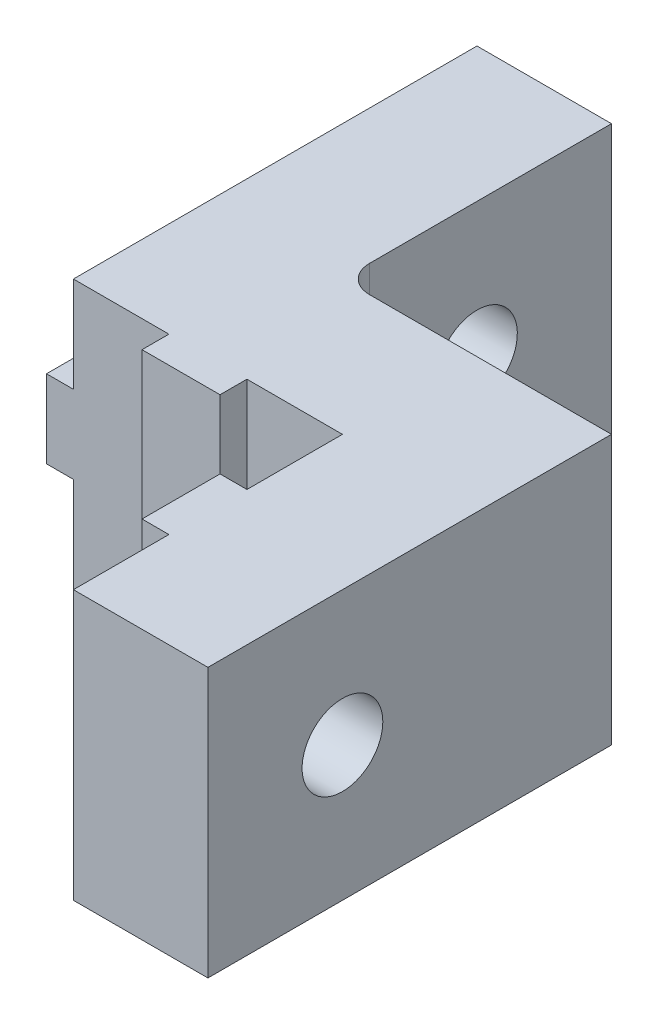
ISO-10303-21;
HEADER;
FILE_DESCRIPTION(('STEP AP214'),'2;1');
FILE_NAME('part.step','',(''),(''),'','','');
FILE_SCHEMA(('AUTOMOTIVE_DESIGN { 1 0 10303 214 1 1 1 1 }'));
ENDSEC;
DATA;
#1=APPLICATION_CONTEXT('core data for automotive mechanical design processes');
#2=APPLICATION_PROTOCOL_DEFINITION('international standard','automotive_design',2000,#1);
#3=PRODUCT_CONTEXT('',#1,'mechanical');
#4=PRODUCT('Part','Part','',(#3));
#5=PRODUCT_RELATED_PRODUCT_CATEGORY('part','',(#4));
#6=PRODUCT_DEFINITION_FORMATION('','',#4);
#7=PRODUCT_DEFINITION_CONTEXT('part definition',#1,'design');
#8=PRODUCT_DEFINITION('design','',#6,#7);
#9=PRODUCT_DEFINITION_SHAPE('','',#8);
#10=(LENGTH_UNIT() NAMED_UNIT(*) SI_UNIT(.MILLI.,.METRE.));
#11=(NAMED_UNIT(*) PLANE_ANGLE_UNIT() SI_UNIT($,.RADIAN.));
#12=(NAMED_UNIT(*) SI_UNIT($,.STERADIAN.) SOLID_ANGLE_UNIT());
#13=UNCERTAINTY_MEASURE_WITH_UNIT(LENGTH_MEASURE(1.E-05),#10,'distance_accuracy_value','');
#14=(GEOMETRIC_REPRESENTATION_CONTEXT(3) GLOBAL_UNCERTAINTY_ASSIGNED_CONTEXT((#13)) GLOBAL_UNIT_ASSIGNED_CONTEXT((#10,
#11,#12)) REPRESENTATION_CONTEXT('',''));
#15=CARTESIAN_POINT('',(0.,0.,0.));
#16=DIRECTION('',(0.,0.,1.));
#17=DIRECTION('',(1.,0.,0.));
#18=AXIS2_PLACEMENT_3D('',#15,#16,#17);
#19=CARTESIAN_POINT('',(10.,10.,21.45));
#20=DIRECTION('',(0.,0.,-1.));
#21=DIRECTION('',(-1.,0.,0.));
#22=AXIS2_PLACEMENT_3D('',#19,#20,#21);
#23=PLANE('',#22);
#24=DIRECTION('',(0.,-1.,0.));
#25=VECTOR('',#24,1.);
#26=CARTESIAN_POINT('',(9.,10.,21.45));
#27=LINE('',#26,#25);
#28=CARTESIAN_POINT('',(9.,10.,21.45));
#29=VERTEX_POINT('',#28);
#30=CARTESIAN_POINT('',(9.,5.38405728739343,21.45));
#31=VERTEX_POINT('',#30);
#32=EDGE_CURVE('E422',#29,#31,#27,.T.);
#33=ORIENTED_EDGE('',*,*,#32,.T.);
#34=DIRECTION('',(1.,0.,0.));
#35=VECTOR('',#34,1.);
#36=CARTESIAN_POINT('',(-1.,5.38405728739343,21.45));
#37=LINE('',#36,#35);
#38=CARTESIAN_POINT('',(10.,5.38405728739343,21.45));
#39=VERTEX_POINT('',#38);
#40=EDGE_CURVE('E499',#31,#39,#37,.T.);
#41=ORIENTED_EDGE('',*,*,#40,.T.);
#42=DIRECTION('',(0.,-1.,0.));
#43=VECTOR('',#42,1.);
#44=CARTESIAN_POINT('',(10.,10.,21.45));
#45=LINE('',#44,#43);
#46=CARTESIAN_POINT('',(10.,10.,21.45));
#47=VERTEX_POINT('',#46);
#48=EDGE_CURVE('E274',#47,#39,#45,.T.);
#49=ORIENTED_EDGE('',*,*,#48,.F.);
#50=DIRECTION('',(1.,0.,0.));
#51=VECTOR('',#50,1.);
#52=CARTESIAN_POINT('',(10.,10.,21.45));
#53=LINE('',#52,#51);
#54=EDGE_CURVE('E269',#29,#47,#53,.T.);
#55=ORIENTED_EDGE('',*,*,#54,.F.);
#56=EDGE_LOOP('',(#33,#41,#49,#55));
#57=FACE_BOUND('',#56,.T.);
#58=ADVANCED_FACE('F32',(#57),#23,.F.);
#59=CARTESIAN_POINT('',(9.,10.,21.45));
#60=DIRECTION('',(1.,0.,0.));
#61=DIRECTION('',(0.,0.,-1.));
#62=AXIS2_PLACEMENT_3D('',#59,#60,#61);
#63=PLANE('',#62);
#64=DIRECTION('',(0.,-1.,0.));
#65=VECTOR('',#64,1.);
#66=CARTESIAN_POINT('',(9.,10.,18.55));
#67=LINE('',#66,#65);
#68=CARTESIAN_POINT('',(9.,10.,18.55));
#69=VERTEX_POINT('',#68);
#70=CARTESIAN_POINT('',(9.,5.38405728739343,18.55));
#71=VERTEX_POINT('',#70);
#72=EDGE_CURVE('E253',#69,#71,#67,.T.);
#73=ORIENTED_EDGE('',*,*,#72,.T.);
#74=CARTESIAN_POINT('',(9.,5.,20.));
#75=DIRECTION('',(1.,0.,0.));
#76=DIRECTION('',(0.,0.,-1.));
#77=AXIS2_PLACEMENT_3D('',#74,#75,#76);
#78=CIRCLE('',#77,1.5);
#79=EDGE_CURVE('E503',#71,#31,#78,.T.);
#80=ORIENTED_EDGE('',*,*,#79,.T.);
#81=ORIENTED_EDGE('',*,*,#32,.F.);
#82=DIRECTION('',(0.,0.,1.));
#83=VECTOR('',#82,1.);
#84=CARTESIAN_POINT('',(9.,10.,21.45));
#85=LINE('',#84,#83);
#86=EDGE_CURVE('E453',#69,#29,#85,.T.);
#87=ORIENTED_EDGE('',*,*,#86,.F.);
#88=EDGE_LOOP('',(#73,#80,#81,#87));
#89=FACE_BOUND('',#88,.T.);
#90=ADVANCED_FACE('F388',(#89),#63,.F.);
#91=CARTESIAN_POINT('',(9.,10.,18.55));
#92=DIRECTION('',(0.,0.,1.));
#93=DIRECTION('',(1.,0.,0.));
#94=AXIS2_PLACEMENT_3D('',#91,#92,#93);
#95=PLANE('',#94);
#96=CARTESIAN_POINT('',(9.,4.61594271260657,18.55));
#97=VERTEX_POINT('',#96);
#98=CARTESIAN_POINT('',(9.,0.,18.55));
#99=VERTEX_POINT('',#98);
#100=EDGE_CURVE('E240',#97,#99,#67,.T.);
#101=ORIENTED_EDGE('',*,*,#100,.F.);
#102=DIRECTION('',(1.,0.,0.));
#103=VECTOR('',#102,1.);
#104=CARTESIAN_POINT('',(-1.,4.61594271260657,18.55));
#105=LINE('',#104,#103);
#106=CARTESIAN_POINT('',(10.,4.61594271260657,18.55));
#107=VERTEX_POINT('',#106);
#108=EDGE_CURVE('E224',#97,#107,#105,.T.);
#109=ORIENTED_EDGE('',*,*,#108,.T.);
#110=DIRECTION('',(0.,-1.,0.));
#111=VECTOR('',#110,1.);
#112=CARTESIAN_POINT('',(10.,10.,18.55));
#113=LINE('',#112,#111);
#114=CARTESIAN_POINT('',(10.,0.,18.55));
#115=VERTEX_POINT('',#114);
#116=EDGE_CURVE('E238',#107,#115,#113,.T.);
#117=ORIENTED_EDGE('',*,*,#116,.T.);
#118=DIRECTION('',(-1.,0.,0.));
#119=VECTOR('',#118,1.);
#120=CARTESIAN_POINT('',(9.,0.,18.55));
#121=LINE('',#120,#119);
#122=EDGE_CURVE('E432',#115,#99,#121,.T.);
#123=ORIENTED_EDGE('',*,*,#122,.T.);
#124=EDGE_LOOP('',(#101,#109,#117,#123));
#125=FACE_BOUND('',#124,.T.);
#126=ADVANCED_FACE('F236',(#125),#95,.F.);
#127=CARTESIAN_POINT('',(0.,6.45,25.));
#128=DIRECTION('',(0.,-1.,0.));
#129=DIRECTION('',(1.,0.,0.));
#130=AXIS2_PLACEMENT_3D('',#127,#128,#129);
#131=PLANE('',#130);
#132=DIRECTION('',(0.,0.,-1.));
#133=VECTOR('',#132,1.);
#134=CARTESIAN_POINT('',(-1.,6.45,25.));
#135=LINE('',#134,#133);
#136=CARTESIAN_POINT('',(-1.,6.45,4.61594271260657));
#137=VERTEX_POINT('',#136);
#138=CARTESIAN_POINT('',(-1.,6.45,0.));
#139=VERTEX_POINT('',#138);
#140=EDGE_CURVE('E340',#137,#139,#135,.T.);
#141=ORIENTED_EDGE('',*,*,#140,.F.);
#142=DIRECTION('',(1.,0.,0.));
#143=VECTOR('',#142,1.);
#144=CARTESIAN_POINT('',(-0.999999999999998,6.45,4.61594271260657));
#145=LINE('',#144,#143);
#146=CARTESIAN_POINT('',(0.,6.45,4.61594271260656));
#147=VERTEX_POINT('',#146);
#148=EDGE_CURVE('E451',#137,#147,#145,.T.);
#149=ORIENTED_EDGE('',*,*,#148,.T.);
#150=DIRECTION('',(0.,0.,-1.));
#151=VECTOR('',#150,1.);
#152=CARTESIAN_POINT('',(0.,6.45,25.));
#153=LINE('',#152,#151);
#154=CARTESIAN_POINT('',(0.,6.45,0.));
#155=VERTEX_POINT('',#154);
#156=EDGE_CURVE('E344',#147,#155,#153,.T.);
#157=ORIENTED_EDGE('',*,*,#156,.T.);
#158=DIRECTION('',(-1.,0.,0.));
#159=VECTOR('',#158,1.);
#160=CARTESIAN_POINT('',(0.,6.45,0.));
#161=LINE('',#160,#159);
#162=EDGE_CURVE('E311',#155,#139,#161,.T.);
#163=ORIENTED_EDGE('',*,*,#162,.T.);
#164=EDGE_LOOP('',(#141,#149,#157,#163));
#165=FACE_BOUND('',#164,.T.);
#166=ADVANCED_FACE('F557',(#165),#131,.F.);
#167=CARTESIAN_POINT('',(-1.,6.45,25.));
#168=DIRECTION('',(1.,0.,0.));
#169=DIRECTION('',(0.,0.,-1.));
#170=AXIS2_PLACEMENT_3D('',#167,#168,#169);
#171=PLANE('',#170);
#172=CARTESIAN_POINT('',(-1.,6.45,15.));
#173=VERTEX_POINT('',#172);
#174=CARTESIAN_POINT('',(-1.,6.45,5.38405728739343));
#175=VERTEX_POINT('',#174);
#176=EDGE_CURVE('E341',#173,#175,#135,.T.);
#177=ORIENTED_EDGE('',*,*,#176,.T.);
#178=CARTESIAN_POINT('',(-1.,5.,5.));
#179=DIRECTION('',(1.,0.,0.));
#180=DIRECTION('',(0.,0.,-1.));
#181=AXIS2_PLACEMENT_3D('',#178,#179,#180);
#182=CIRCLE('',#181,1.5);
#183=CARTESIAN_POINT('',(-1.,3.55,5.38405728739344));
#184=VERTEX_POINT('',#183);
#185=EDGE_CURVE('E352',#175,#184,#182,.T.);
#186=ORIENTED_EDGE('',*,*,#185,.T.);
#187=DIRECTION('',(0.,0.,-1.));
#188=VECTOR('',#187,1.);
#189=CARTESIAN_POINT('',(-1.,3.55,25.));
#190=LINE('',#189,#188);
#191=CARTESIAN_POINT('',(-1.,3.55,15.));
#192=VERTEX_POINT('',#191);
#193=EDGE_CURVE('E337',#192,#184,#190,.T.);
#194=ORIENTED_EDGE('',*,*,#193,.F.);
#195=DIRECTION('',(0.,-1.,0.));
#196=VECTOR('',#195,1.);
#197=CARTESIAN_POINT('',(-1.,10.,15.));
#198=LINE('',#197,#196);
#199=EDGE_CURVE('E264',#173,#192,#198,.T.);
#200=ORIENTED_EDGE('',*,*,#199,.F.);
#201=EDGE_LOOP('',(#177,#186,#194,#200));
#202=FACE_BOUND('',#201,.T.);
#203=ADVANCED_FACE('F552',(#202),#171,.F.);
#204=CARTESIAN_POINT('',(-1.,3.55,25.));
#205=DIRECTION('',(0.,1.,0.));
#206=DIRECTION('',(-1.,0.,0.));
#207=AXIS2_PLACEMENT_3D('',#204,#205,#206);
#208=PLANE('',#207);
#209=ORIENTED_EDGE('',*,*,#193,.T.);
#210=DIRECTION('',(1.,0.,0.));
#211=VECTOR('',#210,1.);
#212=CARTESIAN_POINT('',(-1.,3.55,5.38405728739344));
#213=LINE('',#212,#211);
#214=CARTESIAN_POINT('',(0.,3.55,5.38405728739344));
#215=VERTEX_POINT('',#214);
#216=EDGE_CURVE('E486',#184,#215,#213,.T.);
#217=ORIENTED_EDGE('',*,*,#216,.T.);
#218=DIRECTION('',(0.,0.,-1.));
#219=VECTOR('',#218,1.);
#220=CARTESIAN_POINT('',(0.,3.55,25.));
#221=LINE('',#220,#219);
#222=CARTESIAN_POINT('',(0.,3.55,15.));
#223=VERTEX_POINT('',#222);
#224=EDGE_CURVE('E333',#223,#215,#221,.T.);
#225=ORIENTED_EDGE('',*,*,#224,.F.);
#226=DIRECTION('',(-1.,0.,0.));
#227=VECTOR('',#226,1.);
#228=CARTESIAN_POINT('',(-1.,3.55,15.));
#229=LINE('',#228,#227);
#230=EDGE_CURVE('E273',#223,#192,#229,.T.);
#231=ORIENTED_EDGE('',*,*,#230,.T.);
#232=EDGE_LOOP('',(#209,#217,#225,#231));
#233=FACE_BOUND('',#232,.T.);
#234=ADVANCED_FACE('F547',(#233),#208,.F.);
#235=CARTESIAN_POINT('',(15.,10.,25.));
#236=DIRECTION('',(0.,-1.,0.));
#237=DIRECTION('',(0.,0.,-1.));
#238=AXIS2_PLACEMENT_3D('',#235,#236,#237);
#239=PLANE('',#238);
#240=ORIENTED_EDGE('',*,*,#54,.T.);
#241=DIRECTION('',(0.,0.,1.));
#242=VECTOR('',#241,1.);
#243=CARTESIAN_POINT('',(10.,10.,25.));
#244=LINE('',#243,#242);
#245=CARTESIAN_POINT('',(10.,10.,25.));
#246=VERTEX_POINT('',#245);
#247=EDGE_CURVE('E428',#47,#246,#244,.T.);
#248=ORIENTED_EDGE('',*,*,#247,.T.);
#249=DIRECTION('',(-1.,0.,0.));
#250=VECTOR('',#249,1.);
#251=CARTESIAN_POINT('',(15.,10.,25.));
#252=LINE('',#251,#250);
#253=CARTESIAN_POINT('',(15.,10.,25.));
#254=VERTEX_POINT('',#253);
#255=EDGE_CURVE('E297',#254,#246,#252,.T.);
#256=ORIENTED_EDGE('',*,*,#255,.F.);
#257=DIRECTION('',(0.,0.,-1.));
#258=VECTOR('',#257,1.);
#259=CARTESIAN_POINT('',(15.,10.,25.));
#260=LINE('',#259,#258);
#261=CARTESIAN_POINT('',(15.,10.,10.));
#262=VERTEX_POINT('',#261);
#263=EDGE_CURVE('E305',#254,#262,#260,.T.);
#264=ORIENTED_EDGE('',*,*,#263,.T.);
#265=DIRECTION('',(-1.,0.,0.));
#266=VECTOR('',#265,1.);
#267=CARTESIAN_POINT('',(15.,10.,10.));
#268=LINE('',#267,#266);
#269=CARTESIAN_POINT('',(6.,10.,10.));
#270=VERTEX_POINT('',#269);
#271=EDGE_CURVE('E284',#262,#270,#268,.T.);
#272=ORIENTED_EDGE('',*,*,#271,.T.);
#273=CARTESIAN_POINT('',(6.,10.,9.));
#274=DIRECTION('',(0.,-1.,0.));
#275=DIRECTION('',(0.,0.,-1.));
#276=AXIS2_PLACEMENT_3D('',#273,#274,#275);
#277=CIRCLE('',#276,1.);
#278=CARTESIAN_POINT('',(5.,10.,9.));
#279=VERTEX_POINT('',#278);
#280=EDGE_CURVE('E11',#270,#279,#277,.T.);
#281=ORIENTED_EDGE('',*,*,#280,.T.);
#282=DIRECTION('',(0.,0.,-1.));
#283=VECTOR('',#282,1.);
#284=CARTESIAN_POINT('',(5.,10.,0.));
#285=LINE('',#284,#283);
#286=CARTESIAN_POINT('',(5.,10.,0.));
#287=VERTEX_POINT('',#286);
#288=EDGE_CURVE('E286',#279,#287,#285,.T.);
#289=ORIENTED_EDGE('',*,*,#288,.T.);
#290=DIRECTION('',(-1.,0.,0.));
#291=VECTOR('',#290,1.);
#292=CARTESIAN_POINT('',(15.,10.,0.));
#293=LINE('',#292,#291);
#294=CARTESIAN_POINT('',(0.,10.,0.));
#295=VERTEX_POINT('',#294);
#296=EDGE_CURVE('E295',#287,#295,#293,.T.);
#297=ORIENTED_EDGE('',*,*,#296,.T.);
#298=DIRECTION('',(0.,0.,-1.));
#299=VECTOR('',#298,1.);
#300=CARTESIAN_POINT('',(0.,10.,25.));
#301=LINE('',#300,#299);
#302=CARTESIAN_POINT('',(0.,10.,15.));
#303=VERTEX_POINT('',#302);
#304=EDGE_CURVE('E232',#303,#295,#301,.T.);
#305=ORIENTED_EDGE('',*,*,#304,.F.);
#306=DIRECTION('',(1.,0.,0.));
#307=VECTOR('',#306,1.);
#308=CARTESIAN_POINT('',(3.55,10.,15.));
#309=LINE('',#308,#307);
#310=CARTESIAN_POINT('',(3.55,10.,15.));
#311=VERTEX_POINT('',#310);
#312=EDGE_CURVE('E474',#303,#311,#309,.T.);
#313=ORIENTED_EDGE('',*,*,#312,.T.);
#314=DIRECTION('',(0.,0.,1.));
#315=VECTOR('',#314,1.);
#316=CARTESIAN_POINT('',(3.55,10.,16.));
#317=LINE('',#316,#315);
#318=CARTESIAN_POINT('',(3.55,10.,16.));
#319=VERTEX_POINT('',#318);
#320=EDGE_CURVE('E471',#311,#319,#317,.T.);
#321=ORIENTED_EDGE('',*,*,#320,.T.);
#322=DIRECTION('',(1.,0.,0.));
#323=VECTOR('',#322,1.);
#324=CARTESIAN_POINT('',(6.45,10.,16.));
#325=LINE('',#324,#323);
#326=CARTESIAN_POINT('',(6.45,10.,16.));
#327=VERTEX_POINT('',#326);
#328=EDGE_CURVE('E468',#319,#327,#325,.T.);
#329=ORIENTED_EDGE('',*,*,#328,.T.);
#330=DIRECTION('',(0.,0.,-1.));
#331=VECTOR('',#330,1.);
#332=CARTESIAN_POINT('',(6.45,10.,15.));
#333=LINE('',#332,#331);
#334=CARTESIAN_POINT('',(6.45,10.,15.));
#335=VERTEX_POINT('',#334);
#336=EDGE_CURVE('E465',#327,#335,#333,.T.);
#337=ORIENTED_EDGE('',*,*,#336,.T.);
#338=DIRECTION('',(1.,0.,0.));
#339=VECTOR('',#338,1.);
#340=CARTESIAN_POINT('',(10.,10.,15.));
#341=LINE('',#340,#339);
#342=CARTESIAN_POINT('',(10.,10.,15.));
#343=VERTEX_POINT('',#342);
#344=EDGE_CURVE('E462',#335,#343,#341,.T.);
#345=ORIENTED_EDGE('',*,*,#344,.T.);
#346=DIRECTION('',(0.,0.,1.));
#347=VECTOR('',#346,1.);
#348=CARTESIAN_POINT('',(10.,10.,18.55));
#349=LINE('',#348,#347);
#350=CARTESIAN_POINT('',(10.,10.,18.55));
#351=VERTEX_POINT('',#350);
#352=EDGE_CURVE('E459',#343,#351,#349,.T.);
#353=ORIENTED_EDGE('',*,*,#352,.T.);
#354=DIRECTION('',(-1.,0.,0.));
#355=VECTOR('',#354,1.);
#356=CARTESIAN_POINT('',(9.,10.,18.55));
#357=LINE('',#356,#355);
#358=EDGE_CURVE('E456',#351,#69,#357,.T.);
#359=ORIENTED_EDGE('',*,*,#358,.T.);
#360=ORIENTED_EDGE('',*,*,#86,.T.);
#361=EDGE_LOOP('',(#240,#248,#256,#264,#272,#281,#289,#297,#305,#313,#321,#329,#337,#345,#353,
#359,#360));
#362=FACE_BOUND('',#361,.T.);
#363=ADVANCED_FACE('F378',(#362),#239,.F.);
#364=CARTESIAN_POINT('',(0.,10.,25.));
#365=DIRECTION('',(1.,0.,0.));
#366=DIRECTION('',(0.,1.,0.));
#367=AXIS2_PLACEMENT_3D('',#364,#365,#366);
#368=PLANE('',#367);
#369=ORIENTED_EDGE('',*,*,#156,.F.);
#370=CARTESIAN_POINT('',(0.,5.,5.));
#371=DIRECTION('',(1.,0.,0.));
#372=DIRECTION('',(0.,1.,0.));
#373=AXIS2_PLACEMENT_3D('',#370,#371,#372);
#374=CIRCLE('',#373,1.5);
#375=CARTESIAN_POINT('',(0.,6.45,5.38405728739343));
#376=VERTEX_POINT('',#375);
#377=EDGE_CURVE('E480',#147,#376,#374,.T.);
#378=ORIENTED_EDGE('',*,*,#377,.T.);
#379=CARTESIAN_POINT('',(0.,6.45,15.));
#380=VERTEX_POINT('',#379);
#381=EDGE_CURVE('E345',#380,#376,#153,.T.);
#382=ORIENTED_EDGE('',*,*,#381,.F.);
#383=DIRECTION('',(0.,1.,0.));
#384=VECTOR('',#383,1.);
#385=CARTESIAN_POINT('',(0.,10.,15.));
#386=LINE('',#385,#384);
#387=EDGE_CURVE('E280',#380,#303,#386,.T.);
#388=ORIENTED_EDGE('',*,*,#387,.T.);
#389=ORIENTED_EDGE('',*,*,#304,.T.);
#390=DIRECTION('',(0.,-1.,0.));
#391=VECTOR('',#390,1.);
#392=CARTESIAN_POINT('',(0.,10.,0.));
#393=LINE('',#392,#391);
#394=EDGE_CURVE('E308',#295,#155,#393,.T.);
#395=ORIENTED_EDGE('',*,*,#394,.T.);
#396=EDGE_LOOP('',(#369,#378,#382,#388,#389,#395));
#397=FACE_BOUND('',#396,.T.);
#398=ADVANCED_FACE('F555',(#397),#368,.F.);
#399=ORIENTED_EDGE('',*,*,#381,.T.);
#400=DIRECTION('',(1.,0.,0.));
#401=VECTOR('',#400,1.);
#402=CARTESIAN_POINT('',(-0.999999999999998,6.45,5.38405728739343));
#403=LINE('',#402,#401);
#404=EDGE_CURVE('E483',#376,#175,#403,.F.);
#405=ORIENTED_EDGE('',*,*,#404,.T.);
#406=ORIENTED_EDGE('',*,*,#176,.F.);
#407=DIRECTION('',(1.,0.,0.));
#408=VECTOR('',#407,1.);
#409=CARTESIAN_POINT('',(0.,6.45,15.));
#410=LINE('',#409,#408);
#411=EDGE_CURVE('E277',#173,#380,#410,.T.);
#412=ORIENTED_EDGE('',*,*,#411,.T.);
#413=EDGE_LOOP('',(#399,#405,#406,#412));
#414=FACE_BOUND('',#413,.T.);
#415=ADVANCED_FACE('F550',(#414),#131,.F.);
#416=CARTESIAN_POINT('',(-1.,3.55,4.61594271260656));
#417=VERTEX_POINT('',#416);
#418=CARTESIAN_POINT('',(-1.,3.55,0.));
#419=VERTEX_POINT('',#418);
#420=EDGE_CURVE('E336',#417,#419,#190,.T.);
#421=ORIENTED_EDGE('',*,*,#420,.F.);
#422=EDGE_CURVE('E494',#417,#137,#182,.T.);
#423=ORIENTED_EDGE('',*,*,#422,.T.);
#424=ORIENTED_EDGE('',*,*,#140,.T.);
#425=DIRECTION('',(0.,-1.,0.));
#426=VECTOR('',#425,1.);
#427=CARTESIAN_POINT('',(-1.,6.45,0.));
#428=LINE('',#427,#426);
#429=EDGE_CURVE('E314',#139,#419,#428,.T.);
#430=ORIENTED_EDGE('',*,*,#429,.T.);
#431=EDGE_LOOP('',(#421,#423,#424,#430));
#432=FACE_BOUND('',#431,.T.);
#433=ADVANCED_FACE('F545',(#432),#171,.F.);
#434=CARTESIAN_POINT('',(0.,3.55,4.61594271260656));
#435=VERTEX_POINT('',#434);
#436=CARTESIAN_POINT('',(0.,3.55,0.));
#437=VERTEX_POINT('',#436);
#438=EDGE_CURVE('E332',#435,#437,#221,.T.);
#439=ORIENTED_EDGE('',*,*,#438,.F.);
#440=DIRECTION('',(1.,0.,0.));
#441=VECTOR('',#440,1.);
#442=CARTESIAN_POINT('',(-1.,3.55,4.61594271260656));
#443=LINE('',#442,#441);
#444=EDGE_CURVE('E489',#435,#417,#443,.F.);
#445=ORIENTED_EDGE('',*,*,#444,.T.);
#446=ORIENTED_EDGE('',*,*,#420,.T.);
#447=DIRECTION('',(1.,0.,0.));
#448=VECTOR('',#447,1.);
#449=CARTESIAN_POINT('',(-1.,3.55,0.));
#450=LINE('',#449,#448);
#451=EDGE_CURVE('E317',#419,#437,#450,.T.);
#452=ORIENTED_EDGE('',*,*,#451,.T.);
#453=EDGE_LOOP('',(#439,#445,#446,#452));
#454=FACE_BOUND('',#453,.T.);
#455=ADVANCED_FACE('F541',(#454),#208,.F.);
#456=CARTESIAN_POINT('',(0.,3.55,25.));
#457=DIRECTION('',(1.,0.,0.));
#458=DIRECTION('',(0.,0.,-1.));
#459=AXIS2_PLACEMENT_3D('',#456,#457,#458);
#460=PLANE('',#459);
#461=ORIENTED_EDGE('',*,*,#224,.T.);
#462=CARTESIAN_POINT('',(0.,5.,5.));
#463=DIRECTION('',(1.,0.,0.));
#464=DIRECTION('',(0.,0.,-1.));
#465=AXIS2_PLACEMENT_3D('',#462,#463,#464);
#466=CIRCLE('',#465,1.5);
#467=EDGE_CURVE('E351',#215,#435,#466,.T.);
#468=ORIENTED_EDGE('',*,*,#467,.T.);
#469=ORIENTED_EDGE('',*,*,#438,.T.);
#470=DIRECTION('',(0.,-1.,0.));
#471=VECTOR('',#470,1.);
#472=CARTESIAN_POINT('',(0.,3.55,0.));
#473=LINE('',#472,#471);
#474=CARTESIAN_POINT('',(0.,0.,0.));
#475=VERTEX_POINT('',#474);
#476=EDGE_CURVE('E320',#437,#475,#473,.T.);
#477=ORIENTED_EDGE('',*,*,#476,.T.);
#478=DIRECTION('',(0.,0.,-1.));
#479=VECTOR('',#478,1.);
#480=CARTESIAN_POINT('',(0.,0.,25.));
#481=LINE('',#480,#479);
#482=CARTESIAN_POINT('',(0.,0.,15.));
#483=VERTEX_POINT('',#482);
#484=EDGE_CURVE('E330',#483,#475,#481,.T.);
#485=ORIENTED_EDGE('',*,*,#484,.F.);
#486=DIRECTION('',(0.,1.,0.));
#487=VECTOR('',#486,1.);
#488=CARTESIAN_POINT('',(0.,3.55,15.));
#489=LINE('',#488,#487);
#490=EDGE_CURVE('E270',#483,#223,#489,.T.);
#491=ORIENTED_EDGE('',*,*,#490,.T.);
#492=EDGE_LOOP('',(#461,#468,#469,#477,#485,#491));
#493=FACE_BOUND('',#492,.T.);
#494=ADVANCED_FACE('F538',(#493),#460,.F.);
#495=CARTESIAN_POINT('',(0.,0.,25.));
#496=DIRECTION('',(0.,1.,0.));
#497=DIRECTION('',(0.,0.,1.));
#498=AXIS2_PLACEMENT_3D('',#495,#496,#497);
#499=PLANE('',#498);
#500=DIRECTION('',(1.,0.,0.));
#501=VECTOR('',#500,1.);
#502=CARTESIAN_POINT('',(0.,0.,25.));
#503=LINE('',#502,#501);
#504=CARTESIAN_POINT('',(10.,0.,25.));
#505=VERTEX_POINT('',#504);
#506=CARTESIAN_POINT('',(15.,0.,25.));
#507=VERTEX_POINT('',#506);
#508=EDGE_CURVE('E300',#505,#507,#503,.T.);
#509=ORIENTED_EDGE('',*,*,#508,.F.);
#510=DIRECTION('',(0.,0.,1.));
#511=VECTOR('',#510,1.);
#512=CARTESIAN_POINT('',(10.,0.,25.));
#513=LINE('',#512,#511);
#514=CARTESIAN_POINT('',(10.,0.,21.45));
#515=VERTEX_POINT('',#514);
#516=EDGE_CURVE('E449',#515,#505,#513,.T.);
#517=ORIENTED_EDGE('',*,*,#516,.F.);
#518=DIRECTION('',(1.,0.,0.));
#519=VECTOR('',#518,1.);
#520=CARTESIAN_POINT('',(10.,0.,21.45));
#521=LINE('',#520,#519);
#522=CARTESIAN_POINT('',(9.,0.,21.45));
#523=VERTEX_POINT('',#522);
#524=EDGE_CURVE('E419',#523,#515,#521,.T.);
#525=ORIENTED_EDGE('',*,*,#524,.F.);
#526=DIRECTION('',(0.,0.,1.));
#527=VECTOR('',#526,1.);
#528=CARTESIAN_POINT('',(9.,0.,21.45));
#529=LINE('',#528,#527);
#530=EDGE_CURVE('E429',#99,#523,#529,.T.);
#531=ORIENTED_EDGE('',*,*,#530,.F.);
#532=ORIENTED_EDGE('',*,*,#122,.F.);
#533=DIRECTION('',(0.,0.,1.));
#534=VECTOR('',#533,1.);
#535=CARTESIAN_POINT('',(10.,0.,18.55));
#536=LINE('',#535,#534);
#537=CARTESIAN_POINT('',(10.,0.,15.));
#538=VERTEX_POINT('',#537);
#539=EDGE_CURVE('E245',#538,#115,#536,.T.);
#540=ORIENTED_EDGE('',*,*,#539,.F.);
#541=DIRECTION('',(1.,0.,0.));
#542=VECTOR('',#541,1.);
#543=CARTESIAN_POINT('',(10.,0.,15.));
#544=LINE('',#543,#542);
#545=CARTESIAN_POINT('',(6.45,0.,15.));
#546=VERTEX_POINT('',#545);
#547=EDGE_CURVE('E435',#546,#538,#544,.T.);
#548=ORIENTED_EDGE('',*,*,#547,.F.);
#549=DIRECTION('',(0.,0.,-1.));
#550=VECTOR('',#549,1.);
#551=CARTESIAN_POINT('',(6.45,0.,15.));
#552=LINE('',#551,#550);
#553=CARTESIAN_POINT('',(6.45,0.,16.));
#554=VERTEX_POINT('',#553);
#555=EDGE_CURVE('E438',#554,#546,#552,.T.);
#556=ORIENTED_EDGE('',*,*,#555,.F.);
#557=DIRECTION('',(1.,0.,0.));
#558=VECTOR('',#557,1.);
#559=CARTESIAN_POINT('',(6.45,0.,16.));
#560=LINE('',#559,#558);
#561=CARTESIAN_POINT('',(3.55,0.,16.));
#562=VERTEX_POINT('',#561);
#563=EDGE_CURVE('E441',#562,#554,#560,.T.);
#564=ORIENTED_EDGE('',*,*,#563,.F.);
#565=DIRECTION('',(0.,0.,1.));
#566=VECTOR('',#565,1.);
#567=CARTESIAN_POINT('',(3.55,0.,16.));
#568=LINE('',#567,#566);
#569=CARTESIAN_POINT('',(3.55,0.,15.));
#570=VERTEX_POINT('',#569);
#571=EDGE_CURVE('E444',#570,#562,#568,.T.);
#572=ORIENTED_EDGE('',*,*,#571,.F.);
#573=DIRECTION('',(1.,0.,0.));
#574=VECTOR('',#573,1.);
#575=CARTESIAN_POINT('',(3.55,0.,15.));
#576=LINE('',#575,#574);
#577=EDGE_CURVE('E447',#483,#570,#576,.T.);
#578=ORIENTED_EDGE('',*,*,#577,.F.);
#579=ORIENTED_EDGE('',*,*,#484,.T.);
#580=DIRECTION('',(1.,0.,0.));
#581=VECTOR('',#580,1.);
#582=CARTESIAN_POINT('',(0.,0.,0.));
#583=LINE('',#582,#581);
#584=CARTESIAN_POINT('',(5.,0.,0.));
#585=VERTEX_POINT('',#584);
#586=EDGE_CURVE('E301',#475,#585,#583,.T.);
#587=ORIENTED_EDGE('',*,*,#586,.T.);
#588=DIRECTION('',(0.,0.,-1.));
#589=VECTOR('',#588,1.);
#590=CARTESIAN_POINT('',(5.,0.,0.));
#591=LINE('',#590,#589);
#592=CARTESIAN_POINT('',(5.,0.,9.));
#593=VERTEX_POINT('',#592);
#594=EDGE_CURVE('E287',#593,#585,#591,.T.);
#595=ORIENTED_EDGE('',*,*,#594,.F.);
#596=CARTESIAN_POINT('',(6.,0.,9.));
#597=DIRECTION('',(0.,1.,0.));
#598=DIRECTION('',(0.,0.,1.));
#599=AXIS2_PLACEMENT_3D('',#596,#597,#598);
#600=CIRCLE('',#599,1.);
#601=CARTESIAN_POINT('',(6.,0.,10.));
#602=VERTEX_POINT('',#601);
#603=EDGE_CURVE('E40',#593,#602,#600,.T.);
#604=ORIENTED_EDGE('',*,*,#603,.T.);
#605=DIRECTION('',(-1.,0.,0.));
#606=VECTOR('',#605,1.);
#607=CARTESIAN_POINT('',(15.,0.,10.));
#608=LINE('',#607,#606);
#609=CARTESIAN_POINT('',(15.,0.,10.));
#610=VERTEX_POINT('',#609);
#611=EDGE_CURVE('E283',#610,#602,#608,.T.);
#612=ORIENTED_EDGE('',*,*,#611,.F.);
#613=DIRECTION('',(0.,0.,-1.));
#614=VECTOR('',#613,1.);
#615=CARTESIAN_POINT('',(15.,0.,25.));
#616=LINE('',#615,#614);
#617=EDGE_CURVE('E327',#507,#610,#616,.T.);
#618=ORIENTED_EDGE('',*,*,#617,.F.);
#619=EDGE_LOOP('',(#509,#517,#525,#531,#532,#540,#548,#556,#564,#572,#578,#579,#587,#595,#604,
#612,#618));
#620=FACE_BOUND('',#619,.T.);
#621=ADVANCED_FACE('F364',(#620),#499,.F.);
#622=CARTESIAN_POINT('',(15.,0.,25.));
#623=DIRECTION('',(-1.,0.,0.));
#624=DIRECTION('',(0.,0.,1.));
#625=AXIS2_PLACEMENT_3D('',#622,#623,#624);
#626=PLANE('',#625);
#627=CARTESIAN_POINT('',(15.,5.,20.));
#628=DIRECTION('',(1.,0.,0.));
#629=DIRECTION('',(0.,0.,-1.));
#630=AXIS2_PLACEMENT_3D('',#627,#628,#629);
#631=CIRCLE('',#630,1.5);
#632=CARTESIAN_POINT('',(15.,5.,18.5));
#633=VERTEX_POINT('',#632);
#634=EDGE_CURVE('E506',#633,#633,#631,.T.);
#635=ORIENTED_EDGE('',*,*,#634,.F.);
#636=EDGE_LOOP('',(#635));
#637=FACE_BOUND('',#636,.T.);
#638=ORIENTED_EDGE('',*,*,#617,.T.);
#639=DIRECTION('',(0.,-1.,0.));
#640=VECTOR('',#639,1.);
#641=CARTESIAN_POINT('',(15.,10.,10.));
#642=LINE('',#641,#640);
#643=EDGE_CURVE('E289',#262,#610,#642,.T.);
#644=ORIENTED_EDGE('',*,*,#643,.F.);
#645=ORIENTED_EDGE('',*,*,#263,.F.);
#646=DIRECTION('',(0.,1.,0.));
#647=VECTOR('',#646,1.);
#648=CARTESIAN_POINT('',(15.,0.,25.));
#649=LINE('',#648,#647);
#650=EDGE_CURVE('E303',#507,#254,#649,.T.);
#651=ORIENTED_EDGE('',*,*,#650,.F.);
#652=EDGE_LOOP('',(#638,#644,#645,#651));
#653=FACE_BOUND('',#652,.T.);
#654=ADVANCED_FACE('F510',(#637,#653),#626,.F.);
#655=CARTESIAN_POINT('',(0.,0.,25.));
#656=DIRECTION('',(0.,0.,1.));
#657=DIRECTION('',(1.,0.,0.));
#658=AXIS2_PLACEMENT_3D('',#655,#656,#657);
#659=PLANE('',#658);
#660=DIRECTION('',(0.,-1.,0.));
#661=VECTOR('',#660,1.);
#662=CARTESIAN_POINT('',(10.,10.,25.));
#663=LINE('',#662,#661);
#664=EDGE_CURVE('E266',#246,#505,#663,.T.);
#665=ORIENTED_EDGE('',*,*,#664,.T.);
#666=ORIENTED_EDGE('',*,*,#508,.T.);
#667=ORIENTED_EDGE('',*,*,#650,.T.);
#668=ORIENTED_EDGE('',*,*,#255,.T.);
#669=EDGE_LOOP('',(#665,#666,#667,#668));
#670=FACE_BOUND('',#669,.T.);
#671=ADVANCED_FACE('F513',(#670),#659,.T.);
#672=CARTESIAN_POINT('',(0.,0.,0.));
#673=DIRECTION('',(0.,0.,1.));
#674=DIRECTION('',(1.,0.,0.));
#675=AXIS2_PLACEMENT_3D('',#672,#673,#674);
#676=PLANE('',#675);
#677=ORIENTED_EDGE('',*,*,#296,.F.);
#678=DIRECTION('',(0.,-1.,0.));
#679=VECTOR('',#678,1.);
#680=CARTESIAN_POINT('',(5.,10.,0.));
#681=LINE('',#680,#679);
#682=EDGE_CURVE('E292',#287,#585,#681,.T.);
#683=ORIENTED_EDGE('',*,*,#682,.T.);
#684=ORIENTED_EDGE('',*,*,#586,.F.);
#685=ORIENTED_EDGE('',*,*,#476,.F.);
#686=ORIENTED_EDGE('',*,*,#451,.F.);
#687=ORIENTED_EDGE('',*,*,#429,.F.);
#688=ORIENTED_EDGE('',*,*,#162,.F.);
#689=ORIENTED_EDGE('',*,*,#394,.F.);
#690=EDGE_LOOP('',(#677,#683,#684,#685,#686,#687,#688,#689));
#691=FACE_BOUND('',#690,.T.);
#692=ADVANCED_FACE('F371',(#691),#676,.F.);
#693=CARTESIAN_POINT('',(5.,10.,0.));
#694=DIRECTION('',(-1.,0.,0.));
#695=DIRECTION('',(0.,0.,1.));
#696=AXIS2_PLACEMENT_3D('',#693,#694,#695);
#697=PLANE('',#696);
#698=CARTESIAN_POINT('',(5.,5.,5.));
#699=DIRECTION('',(-1.,0.,0.));
#700=DIRECTION('',(0.,0.,1.));
#701=AXIS2_PLACEMENT_3D('',#698,#699,#700);
#702=CIRCLE('',#701,1.5);
#703=CARTESIAN_POINT('',(5.,5.,6.5));
#704=VERTEX_POINT('',#703);
#705=EDGE_CURVE('E349',#704,#704,#702,.T.);
#706=ORIENTED_EDGE('',*,*,#705,.T.);
#707=EDGE_LOOP('',(#706));
#708=FACE_BOUND('',#707,.T.);
#709=ORIENTED_EDGE('',*,*,#288,.F.);
#710=DIRECTION('',(0.,-1.,0.));
#711=VECTOR('',#710,1.);
#712=CARTESIAN_POINT('',(5.,0.,9.));
#713=LINE('',#712,#711);
#714=EDGE_CURVE('E231',#279,#593,#713,.T.);
#715=ORIENTED_EDGE('',*,*,#714,.T.);
#716=ORIENTED_EDGE('',*,*,#594,.T.);
#717=ORIENTED_EDGE('',*,*,#682,.F.);
#718=EDGE_LOOP('',(#709,#715,#716,#717));
#719=FACE_BOUND('',#718,.T.);
#720=ADVANCED_FACE('F359',(#708,#719),#697,.F.);
#721=CARTESIAN_POINT('',(15.,10.,10.));
#722=DIRECTION('',(0.,0.,1.));
#723=DIRECTION('',(1.,0.,0.));
#724=AXIS2_PLACEMENT_3D('',#721,#722,#723);
#725=PLANE('',#724);
#726=ORIENTED_EDGE('',*,*,#611,.T.);
#727=DIRECTION('',(0.,-1.,0.));
#728=VECTOR('',#727,1.);
#729=CARTESIAN_POINT('',(6.,10.,10.));
#730=LINE('',#729,#728);
#731=EDGE_CURVE('E47',#602,#270,#730,.F.);
#732=ORIENTED_EDGE('',*,*,#731,.T.);
#733=ORIENTED_EDGE('',*,*,#271,.F.);
#734=ORIENTED_EDGE('',*,*,#643,.T.);
#735=EDGE_LOOP('',(#726,#732,#733,#734));
#736=FACE_BOUND('',#735,.T.);
#737=ADVANCED_FACE('F519',(#736),#725,.F.);
#738=CARTESIAN_POINT('',(3.55,10.,15.));
#739=DIRECTION('',(0.,0.,-1.));
#740=DIRECTION('',(-1.,0.,0.));
#741=AXIS2_PLACEMENT_3D('',#738,#739,#740);
#742=PLANE('',#741);
#743=ORIENTED_EDGE('',*,*,#411,.F.);
#744=ORIENTED_EDGE('',*,*,#199,.T.);
#745=ORIENTED_EDGE('',*,*,#230,.F.);
#746=ORIENTED_EDGE('',*,*,#490,.F.);
#747=ORIENTED_EDGE('',*,*,#577,.T.);
#748=DIRECTION('',(0.,-1.,0.));
#749=VECTOR('',#748,1.);
#750=CARTESIAN_POINT('',(3.55,10.,15.));
#751=LINE('',#750,#749);
#752=EDGE_CURVE('E261',#311,#570,#751,.T.);
#753=ORIENTED_EDGE('',*,*,#752,.F.);
#754=ORIENTED_EDGE('',*,*,#312,.F.);
#755=ORIENTED_EDGE('',*,*,#387,.F.);
#756=EDGE_LOOP('',(#743,#744,#745,#746,#747,#753,#754,#755));
#757=FACE_BOUND('',#756,.T.);
#758=ADVANCED_FACE('F409',(#757),#742,.F.);
#759=CARTESIAN_POINT('',(10.,10.,25.));
#760=DIRECTION('',(1.,0.,0.));
#761=DIRECTION('',(0.,0.,-1.));
#762=AXIS2_PLACEMENT_3D('',#759,#760,#761);
#763=PLANE('',#762);
#764=ORIENTED_EDGE('',*,*,#48,.T.);
#765=CARTESIAN_POINT('',(10.,5.,20.));
#766=DIRECTION('',(1.,0.,0.));
#767=DIRECTION('',(0.,0.,-1.));
#768=AXIS2_PLACEMENT_3D('',#765,#766,#767);
#769=CIRCLE('',#768,1.5);
#770=CARTESIAN_POINT('',(10.,4.61594271260657,21.45));
#771=VERTEX_POINT('',#770);
#772=EDGE_CURVE('E497',#39,#771,#769,.T.);
#773=ORIENTED_EDGE('',*,*,#772,.T.);
#774=EDGE_CURVE('E415',#771,#515,#45,.T.);
#775=ORIENTED_EDGE('',*,*,#774,.T.);
#776=ORIENTED_EDGE('',*,*,#516,.T.);
#777=ORIENTED_EDGE('',*,*,#664,.F.);
#778=ORIENTED_EDGE('',*,*,#247,.F.);
#779=EDGE_LOOP('',(#764,#773,#775,#776,#777,#778));
#780=FACE_BOUND('',#779,.T.);
#781=ADVANCED_FACE('F401',(#780),#763,.F.);
#782=ORIENTED_EDGE('',*,*,#774,.F.);
#783=DIRECTION('',(1.,0.,0.));
#784=VECTOR('',#783,1.);
#785=CARTESIAN_POINT('',(-1.,4.61594271260657,21.45));
#786=LINE('',#785,#784);
#787=CARTESIAN_POINT('',(9.,4.61594271260657,21.45));
#788=VERTEX_POINT('',#787);
#789=EDGE_CURVE('E416',#771,#788,#786,.F.);
#790=ORIENTED_EDGE('',*,*,#789,.T.);
#791=EDGE_CURVE('E425',#788,#523,#27,.T.);
#792=ORIENTED_EDGE('',*,*,#791,.T.);
#793=ORIENTED_EDGE('',*,*,#524,.T.);
#794=EDGE_LOOP('',(#782,#790,#792,#793));
#795=FACE_BOUND('',#794,.T.);
#796=ADVANCED_FACE('F391',(#795),#23,.F.);
#797=ORIENTED_EDGE('',*,*,#791,.F.);
#798=EDGE_CURVE('E241',#788,#97,#78,.T.);
#799=ORIENTED_EDGE('',*,*,#798,.T.);
#800=ORIENTED_EDGE('',*,*,#100,.T.);
#801=ORIENTED_EDGE('',*,*,#530,.T.);
#802=EDGE_LOOP('',(#797,#799,#800,#801));
#803=FACE_BOUND('',#802,.T.);
#804=ADVANCED_FACE('F397',(#803),#63,.F.);
#805=CARTESIAN_POINT('',(10.,5.38405728739343,18.55));
#806=VERTEX_POINT('',#805);
#807=EDGE_CURVE('E247',#351,#806,#113,.T.);
#808=ORIENTED_EDGE('',*,*,#807,.T.);
#809=DIRECTION('',(1.,0.,0.));
#810=VECTOR('',#809,1.);
#811=CARTESIAN_POINT('',(-1.,5.38405728739343,18.55));
#812=LINE('',#811,#810);
#813=EDGE_CURVE('E227',#806,#71,#812,.F.);
#814=ORIENTED_EDGE('',*,*,#813,.T.);
#815=ORIENTED_EDGE('',*,*,#72,.F.);
#816=ORIENTED_EDGE('',*,*,#358,.F.);
#817=EDGE_LOOP('',(#808,#814,#815,#816));
#818=FACE_BOUND('',#817,.T.);
#819=ADVANCED_FACE('F407',(#818),#95,.F.);
#820=CARTESIAN_POINT('',(10.,10.,18.55));
#821=DIRECTION('',(1.,0.,0.));
#822=DIRECTION('',(0.,0.,-1.));
#823=AXIS2_PLACEMENT_3D('',#820,#821,#822);
#824=PLANE('',#823);
#825=ORIENTED_EDGE('',*,*,#116,.F.);
#826=CARTESIAN_POINT('',(10.,5.,20.));
#827=DIRECTION('',(1.,0.,0.));
#828=DIRECTION('',(0.,0.,-1.));
#829=AXIS2_PLACEMENT_3D('',#826,#827,#828);
#830=CIRCLE('',#829,1.5);
#831=EDGE_CURVE('E221',#107,#806,#830,.T.);
#832=ORIENTED_EDGE('',*,*,#831,.T.);
#833=ORIENTED_EDGE('',*,*,#807,.F.);
#834=ORIENTED_EDGE('',*,*,#352,.F.);
#835=DIRECTION('',(0.,-1.,0.));
#836=VECTOR('',#835,1.);
#837=CARTESIAN_POINT('',(10.,10.,15.));
#838=LINE('',#837,#836);
#839=EDGE_CURVE('E248',#343,#538,#838,.T.);
#840=ORIENTED_EDGE('',*,*,#839,.T.);
#841=ORIENTED_EDGE('',*,*,#539,.T.);
#842=EDGE_LOOP('',(#825,#832,#833,#834,#840,#841));
#843=FACE_BOUND('',#842,.T.);
#844=ADVANCED_FACE('F243',(#843),#824,.F.);
#845=CARTESIAN_POINT('',(10.,10.,15.));
#846=DIRECTION('',(0.,0.,-1.));
#847=DIRECTION('',(-1.,0.,0.));
#848=AXIS2_PLACEMENT_3D('',#845,#846,#847);
#849=PLANE('',#848);
#850=ORIENTED_EDGE('',*,*,#547,.T.);
#851=ORIENTED_EDGE('',*,*,#839,.F.);
#852=ORIENTED_EDGE('',*,*,#344,.F.);
#853=DIRECTION('',(0.,-1.,0.));
#854=VECTOR('',#853,1.);
#855=CARTESIAN_POINT('',(6.45,10.,15.));
#856=LINE('',#855,#854);
#857=EDGE_CURVE('E250',#335,#546,#856,.T.);
#858=ORIENTED_EDGE('',*,*,#857,.T.);
#859=EDGE_LOOP('',(#850,#851,#852,#858));
#860=FACE_BOUND('',#859,.T.);
#861=ADVANCED_FACE('F597',(#860),#849,.F.);
#862=CARTESIAN_POINT('',(6.45,10.,15.));
#863=DIRECTION('',(-1.,0.,0.));
#864=DIRECTION('',(0.,0.,1.));
#865=AXIS2_PLACEMENT_3D('',#862,#863,#864);
#866=PLANE('',#865);
#867=ORIENTED_EDGE('',*,*,#555,.T.);
#868=ORIENTED_EDGE('',*,*,#857,.F.);
#869=ORIENTED_EDGE('',*,*,#336,.F.);
#870=DIRECTION('',(0.,-1.,0.));
#871=VECTOR('',#870,1.);
#872=CARTESIAN_POINT('',(6.45,10.,16.));
#873=LINE('',#872,#871);
#874=EDGE_CURVE('E257',#327,#554,#873,.T.);
#875=ORIENTED_EDGE('',*,*,#874,.T.);
#876=EDGE_LOOP('',(#867,#868,#869,#875));
#877=FACE_BOUND('',#876,.T.);
#878=ADVANCED_FACE('F593',(#877),#866,.F.);
#879=CARTESIAN_POINT('',(6.45,10.,16.));
#880=DIRECTION('',(0.,0.,-1.));
#881=DIRECTION('',(-1.,0.,0.));
#882=AXIS2_PLACEMENT_3D('',#879,#880,#881);
#883=PLANE('',#882);
#884=ORIENTED_EDGE('',*,*,#563,.T.);
#885=ORIENTED_EDGE('',*,*,#874,.F.);
#886=ORIENTED_EDGE('',*,*,#328,.F.);
#887=DIRECTION('',(0.,-1.,0.));
#888=VECTOR('',#887,1.);
#889=CARTESIAN_POINT('',(3.55,10.,16.));
#890=LINE('',#889,#888);
#891=EDGE_CURVE('E259',#319,#562,#890,.T.);
#892=ORIENTED_EDGE('',*,*,#891,.T.);
#893=EDGE_LOOP('',(#884,#885,#886,#892));
#894=FACE_BOUND('',#893,.T.);
#895=ADVANCED_FACE('F591',(#894),#883,.F.);
#896=CARTESIAN_POINT('',(3.55,10.,16.));
#897=DIRECTION('',(1.,0.,0.));
#898=DIRECTION('',(0.,0.,-1.));
#899=AXIS2_PLACEMENT_3D('',#896,#897,#898);
#900=PLANE('',#899);
#901=ORIENTED_EDGE('',*,*,#571,.T.);
#902=ORIENTED_EDGE('',*,*,#891,.F.);
#903=ORIENTED_EDGE('',*,*,#320,.F.);
#904=ORIENTED_EDGE('',*,*,#752,.T.);
#905=EDGE_LOOP('',(#901,#902,#903,#904));
#906=FACE_BOUND('',#905,.T.);
#907=ADVANCED_FACE('F586',(#906),#900,.F.);
#908=CARTESIAN_POINT('',(-1.,5.,5.));
#909=DIRECTION('',(1.,0.,0.));
#910=DIRECTION('',(0.,0.,-1.));
#911=AXIS2_PLACEMENT_3D('',#908,#909,#910);
#912=CYLINDRICAL_SURFACE('',#911,1.5);
#913=ORIENTED_EDGE('',*,*,#705,.F.);
#914=EDGE_LOOP('',(#913));
#915=FACE_BOUND('',#914,.T.);
#916=ORIENTED_EDGE('',*,*,#422,.F.);
#917=ORIENTED_EDGE('',*,*,#444,.F.);
#918=ORIENTED_EDGE('',*,*,#467,.F.);
#919=ORIENTED_EDGE('',*,*,#216,.F.);
#920=ORIENTED_EDGE('',*,*,#185,.F.);
#921=ORIENTED_EDGE('',*,*,#404,.F.);
#922=ORIENTED_EDGE('',*,*,#377,.F.);
#923=ORIENTED_EDGE('',*,*,#148,.F.);
#924=EDGE_LOOP('',(#916,#917,#918,#919,#920,#921,#922,#923));
#925=FACE_BOUND('',#924,.T.);
#926=ADVANCED_FACE('F384',(#915,#925),#912,.F.);
#927=CARTESIAN_POINT('',(-1.,5.,20.));
#928=DIRECTION('',(1.,0.,0.));
#929=DIRECTION('',(0.,0.,-1.));
#930=AXIS2_PLACEMENT_3D('',#927,#928,#929);
#931=CYLINDRICAL_SURFACE('',#930,1.5);
#932=ORIENTED_EDGE('',*,*,#634,.T.);
#933=EDGE_LOOP('',(#932));
#934=FACE_BOUND('',#933,.T.);
#935=ORIENTED_EDGE('',*,*,#40,.F.);
#936=ORIENTED_EDGE('',*,*,#79,.F.);
#937=ORIENTED_EDGE('',*,*,#813,.F.);
#938=ORIENTED_EDGE('',*,*,#831,.F.);
#939=ORIENTED_EDGE('',*,*,#108,.F.);
#940=ORIENTED_EDGE('',*,*,#798,.F.);
#941=ORIENTED_EDGE('',*,*,#789,.F.);
#942=ORIENTED_EDGE('',*,*,#772,.F.);
#943=EDGE_LOOP('',(#935,#936,#937,#938,#939,#940,#941,#942));
#944=FACE_BOUND('',#943,.T.);
#945=ADVANCED_FACE('F223',(#934,#944),#931,.F.);
#946=CARTESIAN_POINT('',(6.,10.,9.));
#947=DIRECTION('',(0.,1.,0.));
#948=DIRECTION('',(0.,0.,1.));
#949=AXIS2_PLACEMENT_3D('',#946,#947,#948);
#950=CYLINDRICAL_SURFACE('',#949,1.);
#951=ORIENTED_EDGE('',*,*,#280,.F.);
#952=ORIENTED_EDGE('',*,*,#731,.F.);
#953=ORIENTED_EDGE('',*,*,#603,.F.);
#954=ORIENTED_EDGE('',*,*,#714,.F.);
#955=EDGE_LOOP('',(#951,#952,#953,#954));
#956=FACE_BOUND('',#955,.T.);
#957=ADVANCED_FACE('F34',(#956),#950,.F.);
#958=CLOSED_SHELL('',(#58,#90,#126,#166,#203,#234,#363,#398,#415,#433,#455,#494,#621,#654,#671,
#692,#720,#737,#758,#781,#796,#804,#819,#844,#861,#878,#895,#907,#926,#945,#957));
#959=MANIFOLD_SOLID_BREP('B2',#958);
#960=ADVANCED_BREP_SHAPE_REPRESENTATION('',(#18,#959),#14);
#961=SHAPE_DEFINITION_REPRESENTATION(#9,#960);
ENDSEC;
END-ISO-10303-21;
